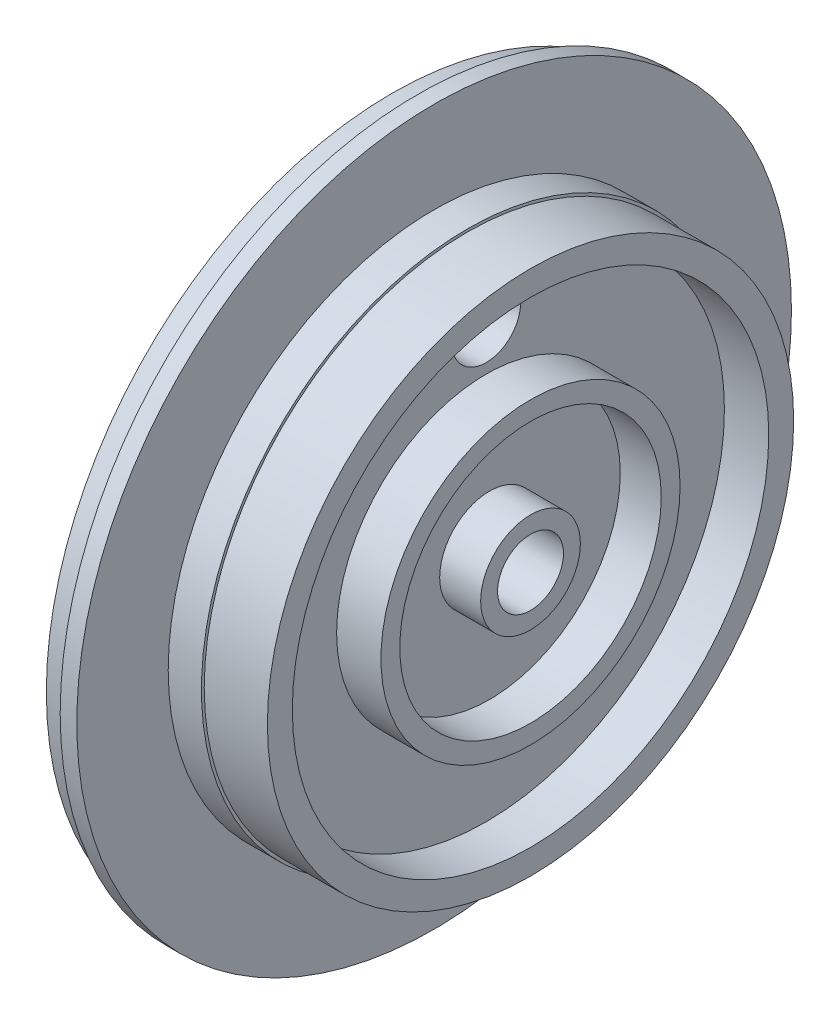
ISO-10303-21;
HEADER;
FILE_DESCRIPTION(('STEP AP214'),'2;1');
FILE_NAME('part.step','',(''),(''),'','','');
FILE_SCHEMA(('AUTOMOTIVE_DESIGN { 1 0 10303 214 1 1 1 1 }'));
ENDSEC;
DATA;
#1=APPLICATION_CONTEXT('core data for automotive mechanical design processes');
#2=APPLICATION_PROTOCOL_DEFINITION('international standard','automotive_design',2000,#1);
#3=PRODUCT_CONTEXT('',#1,'mechanical');
#4=PRODUCT('Part','Part','',(#3));
#5=PRODUCT_RELATED_PRODUCT_CATEGORY('part','',(#4));
#6=PRODUCT_DEFINITION_FORMATION('','',#4);
#7=PRODUCT_DEFINITION_CONTEXT('part definition',#1,'design');
#8=PRODUCT_DEFINITION('design','',#6,#7);
#9=PRODUCT_DEFINITION_SHAPE('','',#8);
#10=(LENGTH_UNIT() NAMED_UNIT(*) SI_UNIT(.MILLI.,.METRE.));
#11=(NAMED_UNIT(*) PLANE_ANGLE_UNIT() SI_UNIT($,.RADIAN.));
#12=(NAMED_UNIT(*) SI_UNIT($,.STERADIAN.) SOLID_ANGLE_UNIT());
#13=UNCERTAINTY_MEASURE_WITH_UNIT(LENGTH_MEASURE(1.E-05),#10,'distance_accuracy_value','');
#14=(GEOMETRIC_REPRESENTATION_CONTEXT(3) GLOBAL_UNCERTAINTY_ASSIGNED_CONTEXT((#13)) GLOBAL_UNIT_ASSIGNED_CONTEXT((#10,
#11,#12)) REPRESENTATION_CONTEXT('',''));
#15=CARTESIAN_POINT('',(0.,0.,0.));
#16=DIRECTION('',(0.,0.,1.));
#17=DIRECTION('',(1.,0.,0.));
#18=AXIS2_PLACEMENT_3D('',#15,#16,#17);
#19=CARTESIAN_POINT('',(-2.8702,0.,0.));
#20=DIRECTION('',(-1.,0.,0.));
#21=DIRECTION('',(0.,0.,1.));
#22=AXIS2_PLACEMENT_3D('',#19,#20,#21);
#23=PLANE('',#22);
#24=CARTESIAN_POINT('',(-2.8702,0.,0.));
#25=DIRECTION('',(-1.,0.,0.));
#26=DIRECTION('',(0.,0.,1.));
#27=AXIS2_PLACEMENT_3D('',#24,#25,#26);
#28=CIRCLE('',#27,0.3175);
#29=CARTESIAN_POINT('',(-2.8702,0.,0.3175));
#30=VERTEX_POINT('',#29);
#31=EDGE_CURVE('E147',#30,#30,#28,.T.);
#32=ORIENTED_EDGE('',*,*,#31,.F.);
#33=EDGE_LOOP('',(#32));
#34=FACE_BOUND('',#33,.T.);
#35=CARTESIAN_POINT('',(-2.8702,0.,0.));
#36=DIRECTION('',(-1.,0.,0.));
#37=DIRECTION('',(0.,0.,1.));
#38=AXIS2_PLACEMENT_3D('',#35,#36,#37);
#39=CIRCLE('',#38,0.508);
#40=CARTESIAN_POINT('',(-2.8702,0.,-0.508));
#41=VERTEX_POINT('',#40);
#42=EDGE_CURVE('E137',#41,#41,#39,.T.);
#43=ORIENTED_EDGE('',*,*,#42,.T.);
#44=EDGE_LOOP('',(#43));
#45=FACE_BOUND('',#44,.T.);
#46=ADVANCED_FACE('F17',(#34,#45),#23,.T.);
#47=CARTESIAN_POINT('',(0.,-1.143,0.));
#48=DIRECTION('',(1.,0.,0.));
#49=DIRECTION('',(0.,1.,0.));
#50=AXIS2_PLACEMENT_3D('',#47,#48,#49);
#51=PLANE('',#50);
#52=CARTESIAN_POINT('',(0.,0.,0.));
#53=DIRECTION('',(1.,0.,0.));
#54=DIRECTION('',(0.,0.,-1.));
#55=AXIS2_PLACEMENT_3D('',#52,#53,#54);
#56=CIRCLE('',#55,0.75564999999999);
#57=CARTESIAN_POINT('',(0.,0.,-0.75564999999999));
#58=VERTEX_POINT('',#57);
#59=EDGE_CURVE('E168',#58,#58,#56,.T.);
#60=ORIENTED_EDGE('',*,*,#59,.F.);
#61=EDGE_LOOP('',(#60));
#62=FACE_BOUND('',#61,.T.);
#63=CARTESIAN_POINT('',(0.,0.,0.));
#64=DIRECTION('',(-1.,0.,0.));
#65=DIRECTION('',(0.,0.,1.));
#66=AXIS2_PLACEMENT_3D('',#63,#64,#65);
#67=CIRCLE('',#66,1.143);
#68=CARTESIAN_POINT('',(0.,0.,-1.143));
#69=VERTEX_POINT('',#68);
#70=EDGE_CURVE('E136',#69,#69,#67,.T.);
#71=ORIENTED_EDGE('',*,*,#70,.F.);
#72=EDGE_LOOP('',(#71));
#73=FACE_BOUND('',#72,.T.);
#74=ADVANCED_FACE('F250',(#62,#73),#51,.T.);
#75=CARTESIAN_POINT('',(0.,0.,0.));
#76=DIRECTION('',(1.,0.,0.));
#77=DIRECTION('',(0.,1.,0.));
#78=AXIS2_PLACEMENT_3D('',#75,#76,#77);
#79=PLANE('',#78);
#80=CARTESIAN_POINT('',(0.,0.,0.));
#81=DIRECTION('',(1.,0.,0.));
#82=DIRECTION('',(0.,0.,-1.));
#83=AXIS2_PLACEMENT_3D('',#80,#81,#82);
#84=CIRCLE('',#83,2.9972);
#85=CARTESIAN_POINT('',(0.,0.,-2.9972));
#86=VERTEX_POINT('',#85);
#87=EDGE_CURVE('E183',#86,#86,#84,.T.);
#88=ORIENTED_EDGE('',*,*,#87,.F.);
#89=EDGE_LOOP('',(#88));
#90=FACE_BOUND('',#89,.T.);
#91=CARTESIAN_POINT('',(0.,0.,0.));
#92=DIRECTION('',(1.,0.,0.));
#93=DIRECTION('',(0.,0.,-1.));
#94=AXIS2_PLACEMENT_3D('',#91,#92,#93);
#95=CIRCLE('',#94,3.429);
#96=CARTESIAN_POINT('',(0.,0.,-3.429));
#97=VERTEX_POINT('',#96);
#98=EDGE_CURVE('E161',#97,#97,#95,.T.);
#99=ORIENTED_EDGE('',*,*,#98,.T.);
#100=EDGE_LOOP('',(#99));
#101=FACE_BOUND('',#100,.T.);
#102=ADVANCED_FACE('F256',(#90,#101),#79,.T.);
#103=CARTESIAN_POINT('',(-0.9398,0.,0.));
#104=DIRECTION('',(1.,0.,0.));
#105=DIRECTION('',(0.,1.,0.));
#106=AXIS2_PLACEMENT_3D('',#103,#104,#105);
#107=PLANE('',#106);
#108=CARTESIAN_POINT('',(-0.9398,0.,0.));
#109=DIRECTION('',(1.,0.,0.));
#110=DIRECTION('',(0.,0.,-1.));
#111=AXIS2_PLACEMENT_3D('',#108,#109,#110);
#112=CIRCLE('',#111,1.143);
#113=CARTESIAN_POINT('',(-0.9398,0.,1.143));
#114=VERTEX_POINT('',#113);
#115=EDGE_CURVE('E144',#114,#114,#112,.T.);
#116=ORIENTED_EDGE('',*,*,#115,.F.);
#117=EDGE_LOOP('',(#116));
#118=FACE_BOUND('',#117,.T.);
#119=CARTESIAN_POINT('',(-0.9398,0.,0.));
#120=DIRECTION('',(1.,0.,0.));
#121=DIRECTION('',(0.,0.,-1.));
#122=AXIS2_PLACEMENT_3D('',#119,#120,#121);
#123=CIRCLE('',#122,2.9972);
#124=CARTESIAN_POINT('',(-0.9398,0.,-2.9972));
#125=VERTEX_POINT('',#124);
#126=EDGE_CURVE('E182',#125,#125,#123,.T.);
#127=ORIENTED_EDGE('',*,*,#126,.T.);
#128=EDGE_LOOP('',(#127));
#129=FACE_BOUND('',#128,.T.);
#130=ADVANCED_FACE('F19',(#118,#129),#107,.T.);
#131=CARTESIAN_POINT('',(-1.016,3.429,0.));
#132=DIRECTION('',(-1.,0.,0.));
#133=DIRECTION('',(0.,0.,1.));
#134=AXIS2_PLACEMENT_3D('',#131,#132,#133);
#135=PLANE('',#134);
#136=CARTESIAN_POINT('',(-1.016,4.445,0.));
#137=DIRECTION('',(1.,0.,0.));
#138=DIRECTION('',(0.,0.,1.));
#139=AXIS2_PLACEMENT_3D('',#136,#137,#138);
#140=CIRCLE('',#139,0.7874);
#141=CARTESIAN_POINT('',(-1.016,4.445,-0.7874));
#142=VERTEX_POINT('',#141);
#143=EDGE_CURVE('E164',#142,#142,#140,.T.);
#144=ORIENTED_EDGE('',*,*,#143,.F.);
#145=EDGE_LOOP('',(#144));
#146=FACE_BOUND('',#145,.T.);
#147=CARTESIAN_POINT('',(-1.016,0.,0.));
#148=DIRECTION('',(1.,0.,0.));
#149=DIRECTION('',(0.,0.,-1.));
#150=AXIS2_PLACEMENT_3D('',#147,#148,#149);
#151=CIRCLE('',#150,3.429);
#152=CARTESIAN_POINT('',(-1.016,0.,3.429));
#153=VERTEX_POINT('',#152);
#154=EDGE_CURVE('E151',#153,#153,#151,.T.);
#155=ORIENTED_EDGE('',*,*,#154,.F.);
#156=EDGE_LOOP('',(#155));
#157=FACE_BOUND('',#156,.T.);
#158=CARTESIAN_POINT('',(-1.016,0.,0.));
#159=DIRECTION('',(1.,0.,0.));
#160=DIRECTION('',(0.,0.,-1.));
#161=AXIS2_PLACEMENT_3D('',#158,#159,#160);
#162=CIRCLE('',#161,5.461);
#163=CARTESIAN_POINT('',(-1.016,0.,-5.461));
#164=VERTEX_POINT('',#163);
#165=EDGE_CURVE('E187',#164,#164,#162,.T.);
#166=ORIENTED_EDGE('',*,*,#165,.T.);
#167=EDGE_LOOP('',(#166));
#168=FACE_BOUND('',#167,.T.);
#169=ADVANCED_FACE('F286',(#146,#157,#168),#135,.F.);
#170=CARTESIAN_POINT('',(-2.6162,0.,0.));
#171=DIRECTION('',(-1.,0.,0.));
#172=DIRECTION('',(0.,0.,1.));
#173=AXIS2_PLACEMENT_3D('',#170,#171,#172);
#174=PLANE('',#173);
#175=CARTESIAN_POINT('',(-2.6162,0.,0.));
#176=DIRECTION('',(-1.,0.,0.));
#177=DIRECTION('',(0.,0.,1.));
#178=AXIS2_PLACEMENT_3D('',#175,#176,#177);
#179=CIRCLE('',#178,0.654646968374167);
#180=CARTESIAN_POINT('',(-2.6162,0.,-0.654646968374167));
#181=VERTEX_POINT('',#180);
#182=EDGE_CURVE('E131',#181,#181,#179,.T.);
#183=ORIENTED_EDGE('',*,*,#182,.F.);
#184=EDGE_LOOP('',(#183));
#185=FACE_BOUND('',#184,.T.);
#186=CARTESIAN_POINT('',(-2.6162,4.445,0.));
#187=DIRECTION('',(-1.,0.,0.));
#188=DIRECTION('',(0.,0.,1.));
#189=AXIS2_PLACEMENT_3D('',#186,#187,#188);
#190=CIRCLE('',#189,0.7874);
#191=CARTESIAN_POINT('',(-2.6162,4.445,0.7874));
#192=VERTEX_POINT('',#191);
#193=EDGE_CURVE('E165',#192,#192,#190,.T.);
#194=ORIENTED_EDGE('',*,*,#193,.F.);
#195=EDGE_LOOP('',(#194));
#196=FACE_BOUND('',#195,.T.);
#197=CARTESIAN_POINT('',(-2.6162,0.,0.));
#198=DIRECTION('',(-1.,0.,0.));
#199=DIRECTION('',(0.,0.,1.));
#200=AXIS2_PLACEMENT_3D('',#197,#198,#199);
#201=CIRCLE('',#200,5.334);
#202=CARTESIAN_POINT('',(-2.6162,0.,5.334));
#203=VERTEX_POINT('',#202);
#204=EDGE_CURVE('E154',#203,#203,#201,.T.);
#205=ORIENTED_EDGE('',*,*,#204,.T.);
#206=EDGE_LOOP('',(#205));
#207=FACE_BOUND('',#206,.T.);
#208=ADVANCED_FACE('F283',(#185,#196,#207),#174,.T.);
#209=CARTESIAN_POINT('',(-3.175,0.,0.));
#210=DIRECTION('',(1.,0.,0.));
#211=DIRECTION('',(0.,1.,0.));
#212=AXIS2_PLACEMENT_3D('',#209,#210,#211);
#213=PLANE('',#212);
#214=CARTESIAN_POINT('',(-3.175,0.,0.));
#215=DIRECTION('',(-1.,0.,0.));
#216=DIRECTION('',(0.,0.,1.));
#217=AXIS2_PLACEMENT_3D('',#214,#215,#216);
#218=CIRCLE('',#217,5.334);
#219=CARTESIAN_POINT('',(-3.175,0.,5.334));
#220=VERTEX_POINT('',#219);
#221=EDGE_CURVE('E152',#220,#220,#218,.T.);
#222=ORIENTED_EDGE('',*,*,#221,.F.);
#223=EDGE_LOOP('',(#222));
#224=FACE_BOUND('',#223,.T.);
#225=CARTESIAN_POINT('',(-3.175,0.,0.));
#226=DIRECTION('',(1.,0.,0.));
#227=DIRECTION('',(0.,0.,-1.));
#228=AXIS2_PLACEMENT_3D('',#225,#226,#227);
#229=CIRCLE('',#228,7.9248);
#230=CARTESIAN_POINT('',(-3.175,0.,7.9248));
#231=VERTEX_POINT('',#230);
#232=EDGE_CURVE('E153',#231,#231,#229,.T.);
#233=ORIENTED_EDGE('',*,*,#232,.F.);
#234=EDGE_LOOP('',(#233));
#235=FACE_BOUND('',#234,.T.);
#236=ADVANCED_FACE('F245',(#224,#235),#213,.F.);
#237=CARTESIAN_POINT('',(0.,0.,0.));
#238=DIRECTION('',(1.,0.,0.));
#239=DIRECTION('',(0.,1.,0.));
#240=AXIS2_PLACEMENT_3D('',#237,#238,#239);
#241=PLANE('',#240);
#242=CARTESIAN_POINT('',(0.,0.,0.));
#243=DIRECTION('',(1.,0.,0.));
#244=DIRECTION('',(0.,0.,-1.));
#245=AXIS2_PLACEMENT_3D('',#242,#243,#244);
#246=CIRCLE('',#245,5.461);
#247=CARTESIAN_POINT('',(0.,0.,-5.461));
#248=VERTEX_POINT('',#247);
#249=EDGE_CURVE('E198',#248,#248,#246,.T.);
#250=ORIENTED_EDGE('',*,*,#249,.F.);
#251=EDGE_LOOP('',(#250));
#252=FACE_BOUND('',#251,.T.);
#253=CARTESIAN_POINT('',(0.,0.,0.));
#254=DIRECTION('',(1.,0.,0.));
#255=DIRECTION('',(0.,0.,-1.));
#256=AXIS2_PLACEMENT_3D('',#253,#254,#255);
#257=CIRCLE('',#256,6.0325);
#258=CARTESIAN_POINT('',(0.,0.,-6.0325));
#259=VERTEX_POINT('',#258);
#260=EDGE_CURVE('E11',#259,#259,#257,.T.);
#261=ORIENTED_EDGE('',*,*,#260,.T.);
#262=EDGE_LOOP('',(#261));
#263=FACE_BOUND('',#262,.T.);
#264=ADVANCED_FACE('F238',(#252,#263),#241,.T.);
#265=CARTESIAN_POINT('',(-2.5908,7.9248,0.));
#266=DIRECTION('',(1.,0.,0.));
#267=DIRECTION('',(0.,1.,0.));
#268=AXIS2_PLACEMENT_3D('',#265,#266,#267);
#269=PLANE('',#268);
#270=CARTESIAN_POINT('',(-2.5908,0.,0.));
#271=DIRECTION('',(1.,0.,0.));
#272=DIRECTION('',(0.,0.,-1.));
#273=AXIS2_PLACEMENT_3D('',#270,#271,#272);
#274=CIRCLE('',#273,7.9248);
#275=CARTESIAN_POINT('',(-2.5908,0.,-7.9248));
#276=VERTEX_POINT('',#275);
#277=EDGE_CURVE('E21',#276,#276,#274,.T.);
#278=ORIENTED_EDGE('',*,*,#277,.T.);
#279=EDGE_LOOP('',(#278));
#280=FACE_BOUND('',#279,.T.);
#281=CARTESIAN_POINT('',(-2.5908,0.,0.));
#282=DIRECTION('',(1.,0.,0.));
#283=DIRECTION('',(0.,0.,-1.));
#284=AXIS2_PLACEMENT_3D('',#281,#282,#283);
#285=CIRCLE('',#284,8.1915);
#286=CARTESIAN_POINT('',(-2.5908,0.,8.1915));
#287=VERTEX_POINT('',#286);
#288=EDGE_CURVE('E160',#287,#287,#285,.T.);
#289=ORIENTED_EDGE('',*,*,#288,.F.);
#290=EDGE_LOOP('',(#289));
#291=FACE_BOUND('',#290,.T.);
#292=ADVANCED_FACE('F227',(#280,#291),#269,.F.);
#293=CARTESIAN_POINT('',(-2.2098,8.1915,0.));
#294=DIRECTION('',(-1.,0.,0.));
#295=DIRECTION('',(0.,0.,1.));
#296=AXIS2_PLACEMENT_3D('',#293,#294,#295);
#297=PLANE('',#296);
#298=CARTESIAN_POINT('',(-2.2098,0.,0.));
#299=DIRECTION('',(1.,0.,0.));
#300=DIRECTION('',(0.,0.,-1.));
#301=AXIS2_PLACEMENT_3D('',#298,#299,#300);
#302=CIRCLE('',#301,6.096);
#303=CARTESIAN_POINT('',(-2.2098,0.,6.096));
#304=VERTEX_POINT('',#303);
#305=EDGE_CURVE('E159',#304,#304,#302,.T.);
#306=ORIENTED_EDGE('',*,*,#305,.F.);
#307=EDGE_LOOP('',(#306));
#308=FACE_BOUND('',#307,.T.);
#309=CARTESIAN_POINT('',(-2.2098,0.,0.));
#310=DIRECTION('',(1.,0.,0.));
#311=DIRECTION('',(0.,0.,-1.));
#312=AXIS2_PLACEMENT_3D('',#309,#310,#311);
#313=CIRCLE('',#312,8.1915);
#314=CARTESIAN_POINT('',(-2.2098,0.,-8.1915));
#315=VERTEX_POINT('',#314);
#316=EDGE_CURVE('E156',#315,#315,#313,.T.);
#317=ORIENTED_EDGE('',*,*,#316,.T.);
#318=EDGE_LOOP('',(#317));
#319=FACE_BOUND('',#318,.T.);
#320=ADVANCED_FACE('F224',(#308,#319),#297,.F.);
#321=CARTESIAN_POINT('',(-1.4478,6.096,0.));
#322=DIRECTION('',(-1.,0.,0.));
#323=DIRECTION('',(0.,0.,1.));
#324=AXIS2_PLACEMENT_3D('',#321,#322,#323);
#325=PLANE('',#324);
#326=CARTESIAN_POINT('',(-1.4478,0.,0.));
#327=DIRECTION('',(1.,0.,0.));
#328=DIRECTION('',(0.,0.,-1.));
#329=AXIS2_PLACEMENT_3D('',#326,#327,#328);
#330=CIRCLE('',#329,6.0325);
#331=CARTESIAN_POINT('',(-1.4478,0.,6.0325));
#332=VERTEX_POINT('',#331);
#333=EDGE_CURVE('E28',#332,#332,#330,.T.);
#334=ORIENTED_EDGE('',*,*,#333,.F.);
#335=EDGE_LOOP('',(#334));
#336=FACE_BOUND('',#335,.T.);
#337=CARTESIAN_POINT('',(-1.4478,0.,0.));
#338=DIRECTION('',(1.,0.,0.));
#339=DIRECTION('',(0.,0.,-1.));
#340=AXIS2_PLACEMENT_3D('',#337,#338,#339);
#341=CIRCLE('',#340,6.096);
#342=CARTESIAN_POINT('',(-1.4478,0.,-6.096));
#343=VERTEX_POINT('',#342);
#344=EDGE_CURVE('E177',#343,#343,#341,.T.);
#345=ORIENTED_EDGE('',*,*,#344,.T.);
#346=EDGE_LOOP('',(#345));
#347=FACE_BOUND('',#346,.T.);
#348=ADVANCED_FACE('F214',(#336,#347),#325,.F.);
#349=CARTESIAN_POINT('',(1.04762077143023,0.,0.));
#350=DIRECTION('',(1.,0.,0.));
#351=DIRECTION('',(0.,0.,-1.));
#352=AXIS2_PLACEMENT_3D('',#349,#350,#351);
#353=CYLINDRICAL_SURFACE('',#352,6.0325);
#354=ORIENTED_EDGE('',*,*,#260,.F.);
#355=EDGE_LOOP('',(#354));
#356=FACE_BOUND('',#355,.T.);
#357=ORIENTED_EDGE('',*,*,#333,.T.);
#358=EDGE_LOOP('',(#357));
#359=FACE_BOUND('',#358,.T.);
#360=ADVANCED_FACE('F220',(#356,#359),#353,.T.);
#361=CARTESIAN_POINT('',(1.04762077143023,0.,0.));
#362=DIRECTION('',(1.,0.,0.));
#363=DIRECTION('',(0.,0.,-1.));
#364=AXIS2_PLACEMENT_3D('',#361,#362,#363);
#365=CYLINDRICAL_SURFACE('',#364,6.096);
#366=ORIENTED_EDGE('',*,*,#344,.F.);
#367=EDGE_LOOP('',(#366));
#368=FACE_BOUND('',#367,.T.);
#369=ORIENTED_EDGE('',*,*,#305,.T.);
#370=EDGE_LOOP('',(#369));
#371=FACE_BOUND('',#370,.T.);
#372=ADVANCED_FACE('F216',(#368,#371),#365,.T.);
#373=CARTESIAN_POINT('',(1.04762077143023,0.,0.));
#374=DIRECTION('',(1.,0.,0.));
#375=DIRECTION('',(0.,0.,-1.));
#376=AXIS2_PLACEMENT_3D('',#373,#374,#375);
#377=CYLINDRICAL_SURFACE('',#376,8.1915);
#378=ORIENTED_EDGE('',*,*,#316,.F.);
#379=EDGE_LOOP('',(#378));
#380=FACE_BOUND('',#379,.T.);
#381=ORIENTED_EDGE('',*,*,#288,.T.);
#382=EDGE_LOOP('',(#381));
#383=FACE_BOUND('',#382,.T.);
#384=ADVANCED_FACE('F219',(#380,#383),#377,.T.);
#385=CARTESIAN_POINT('',(1.04762077143023,0.,0.));
#386=DIRECTION('',(1.,0.,0.));
#387=DIRECTION('',(0.,0.,-1.));
#388=AXIS2_PLACEMENT_3D('',#385,#386,#387);
#389=CYLINDRICAL_SURFACE('',#388,7.9248);
#390=ORIENTED_EDGE('',*,*,#277,.F.);
#391=EDGE_LOOP('',(#390));
#392=FACE_BOUND('',#391,.T.);
#393=ORIENTED_EDGE('',*,*,#232,.T.);
#394=EDGE_LOOP('',(#393));
#395=FACE_BOUND('',#394,.T.);
#396=ADVANCED_FACE('F233',(#392,#395),#389,.T.);
#397=CARTESIAN_POINT('',(-2.6162,0.,0.));
#398=DIRECTION('',(-1.,0.,0.));
#399=DIRECTION('',(0.,0.,1.));
#400=AXIS2_PLACEMENT_3D('',#397,#398,#399);
#401=CYLINDRICAL_SURFACE('',#400,5.334);
#402=ORIENTED_EDGE('',*,*,#221,.T.);
#403=EDGE_LOOP('',(#402));
#404=FACE_BOUND('',#403,.T.);
#405=ORIENTED_EDGE('',*,*,#204,.F.);
#406=EDGE_LOOP('',(#405));
#407=FACE_BOUND('',#406,.T.);
#408=ADVANCED_FACE('F291',(#404,#407),#401,.F.);
#409=CARTESIAN_POINT('',(0.,4.445,0.));
#410=DIRECTION('',(-1.,0.,0.));
#411=DIRECTION('',(0.,0.,1.));
#412=AXIS2_PLACEMENT_3D('',#409,#410,#411);
#413=CYLINDRICAL_SURFACE('',#412,0.7874);
#414=ORIENTED_EDGE('',*,*,#193,.T.);
#415=EDGE_LOOP('',(#414));
#416=FACE_BOUND('',#415,.T.);
#417=ORIENTED_EDGE('',*,*,#143,.T.);
#418=EDGE_LOOP('',(#417));
#419=FACE_BOUND('',#418,.T.);
#420=ADVANCED_FACE('F267',(#416,#419),#413,.F.);
#421=CARTESIAN_POINT('',(1.31385241704219,0.,0.));
#422=DIRECTION('',(1.,0.,0.));
#423=DIRECTION('',(0.,0.,-1.));
#424=AXIS2_PLACEMENT_3D('',#421,#422,#423);
#425=CYLINDRICAL_SURFACE('',#424,3.429);
#426=ORIENTED_EDGE('',*,*,#98,.F.);
#427=EDGE_LOOP('',(#426));
#428=FACE_BOUND('',#427,.T.);
#429=ORIENTED_EDGE('',*,*,#154,.T.);
#430=EDGE_LOOP('',(#429));
#431=FACE_BOUND('',#430,.T.);
#432=ADVANCED_FACE('F264',(#428,#431),#425,.T.);
#433=CARTESIAN_POINT('',(1.31385241704219,0.,0.));
#434=DIRECTION('',(1.,0.,0.));
#435=DIRECTION('',(0.,0.,-1.));
#436=AXIS2_PLACEMENT_3D('',#433,#434,#435);
#437=CYLINDRICAL_SURFACE('',#436,5.461);
#438=ORIENTED_EDGE('',*,*,#249,.T.);
#439=EDGE_LOOP('',(#438));
#440=FACE_BOUND('',#439,.T.);
#441=ORIENTED_EDGE('',*,*,#165,.F.);
#442=EDGE_LOOP('',(#441));
#443=FACE_BOUND('',#442,.T.);
#444=ADVANCED_FACE('F266',(#440,#443),#437,.F.);
#445=CARTESIAN_POINT('',(-0.9398,0.,0.));
#446=DIRECTION('',(1.,0.,0.));
#447=DIRECTION('',(0.,0.,-1.));
#448=AXIS2_PLACEMENT_3D('',#445,#446,#447);
#449=CYLINDRICAL_SURFACE('',#448,2.9972);
#450=ORIENTED_EDGE('',*,*,#87,.T.);
#451=EDGE_LOOP('',(#450));
#452=FACE_BOUND('',#451,.T.);
#453=ORIENTED_EDGE('',*,*,#126,.F.);
#454=EDGE_LOOP('',(#453));
#455=FACE_BOUND('',#454,.T.);
#456=ADVANCED_FACE('F414',(#452,#455),#449,.F.);
#457=CARTESIAN_POINT('',(-2.97665640137026,0.,0.));
#458=DIRECTION('',(-1.,0.,0.));
#459=DIRECTION('',(0.,0.,1.));
#460=AXIS2_PLACEMENT_3D('',#457,#458,#459);
#461=CYLINDRICAL_SURFACE('',#460,1.143);
#462=ORIENTED_EDGE('',*,*,#115,.T.);
#463=EDGE_LOOP('',(#462));
#464=FACE_BOUND('',#463,.T.);
#465=ORIENTED_EDGE('',*,*,#70,.T.);
#466=EDGE_LOOP('',(#465));
#467=FACE_BOUND('',#466,.T.);
#468=ADVANCED_FACE('F262',(#464,#467),#461,.T.);
#469=CARTESIAN_POINT('',(-2.8702,0.,0.));
#470=DIRECTION('',(1.,0.,0.));
#471=DIRECTION('',(0.,0.,-1.));
#472=AXIS2_PLACEMENT_3D('',#469,#470,#471);
#473=CONICAL_SURFACE('',#472,0.508,0.523598775598299);
#474=ORIENTED_EDGE('',*,*,#182,.T.);
#475=EDGE_LOOP('',(#474));
#476=FACE_BOUND('',#475,.T.);
#477=ORIENTED_EDGE('',*,*,#42,.F.);
#478=EDGE_LOOP('',(#477));
#479=FACE_BOUND('',#478,.T.);
#480=ADVANCED_FACE('F132',(#476,#479),#473,.T.);
#481=CARTESIAN_POINT('',(-3.73123437183003,0.,0.));
#482=DIRECTION('',(-1.,0.,0.));
#483=DIRECTION('',(0.,0.,1.));
#484=AXIS2_PLACEMENT_3D('',#481,#482,#483);
#485=CYLINDRICAL_SURFACE('',#484,0.3175);
#486=ORIENTED_EDGE('',*,*,#31,.T.);
#487=EDGE_LOOP('',(#486));
#488=FACE_BOUND('',#487,.T.);
#489=CARTESIAN_POINT('',(-1.39712308022693,0.,0.));
#490=DIRECTION('',(-1.,0.,0.));
#491=DIRECTION('',(0.,0.,-1.));
#492=AXIS2_PLACEMENT_3D('',#489,#490,#491);
#493=CIRCLE('',#492,0.3175);
#494=CARTESIAN_POINT('',(-1.39712308022693,0.,0.3175));
#495=VERTEX_POINT('',#494);
#496=EDGE_CURVE('E170',#495,#495,#493,.T.);
#497=ORIENTED_EDGE('',*,*,#496,.F.);
#498=EDGE_LOOP('',(#497));
#499=FACE_BOUND('',#498,.T.);
#500=ADVANCED_FACE('F353',(#488,#499),#485,.F.);
#501=CARTESIAN_POINT('',(-1.133856,0.,0.));
#502=DIRECTION('',(1.,0.,0.));
#503=DIRECTION('',(0.,0.,-1.));
#504=AXIS2_PLACEMENT_3D('',#501,#502,#503);
#505=CONICAL_SURFACE('',#504,0.75565,1.02974425867665);
#506=CARTESIAN_POINT('',(-1.133856,0.,0.));
#507=DIRECTION('',(1.,0.,0.));
#508=DIRECTION('',(0.,0.,-1.));
#509=AXIS2_PLACEMENT_3D('',#506,#507,#508);
#510=CIRCLE('',#509,0.75565);
#511=CARTESIAN_POINT('',(-1.133856,0.,-0.75565));
#512=VERTEX_POINT('',#511);
#513=EDGE_CURVE('E171',#512,#512,#510,.T.);
#514=ORIENTED_EDGE('',*,*,#513,.T.);
#515=EDGE_LOOP('',(#514));
#516=FACE_BOUND('',#515,.T.);
#517=ORIENTED_EDGE('',*,*,#496,.T.);
#518=EDGE_LOOP('',(#517));
#519=FACE_BOUND('',#518,.T.);
#520=ADVANCED_FACE('F330',(#516,#519),#505,.F.);
#521=CARTESIAN_POINT('',(0.,0.,0.));
#522=DIRECTION('',(1.,0.,0.));
#523=DIRECTION('',(0.,0.,-1.));
#524=AXIS2_PLACEMENT_3D('',#521,#522,#523);
#525=CYLINDRICAL_SURFACE('',#524,0.75565);
#526=ORIENTED_EDGE('',*,*,#59,.T.);
#527=EDGE_LOOP('',(#526));
#528=FACE_BOUND('',#527,.T.);
#529=ORIENTED_EDGE('',*,*,#513,.F.);
#530=EDGE_LOOP('',(#529));
#531=FACE_BOUND('',#530,.T.);
#532=ADVANCED_FACE('F325',(#528,#531),#525,.F.);
#533=CLOSED_SHELL('',(#46,#74,#102,#130,#169,#208,#236,#264,#292,#320,#348,#360,#372,#384,#396,
#408,#420,#432,#444,#456,#468,#480,#500,#520,#532));
#534=MANIFOLD_SOLID_BREP('B1',#533);
#535=ADVANCED_BREP_SHAPE_REPRESENTATION('',(#18,#534),#14);
#536=SHAPE_DEFINITION_REPRESENTATION(#9,#535);
ENDSEC;
END-ISO-10303-21;
